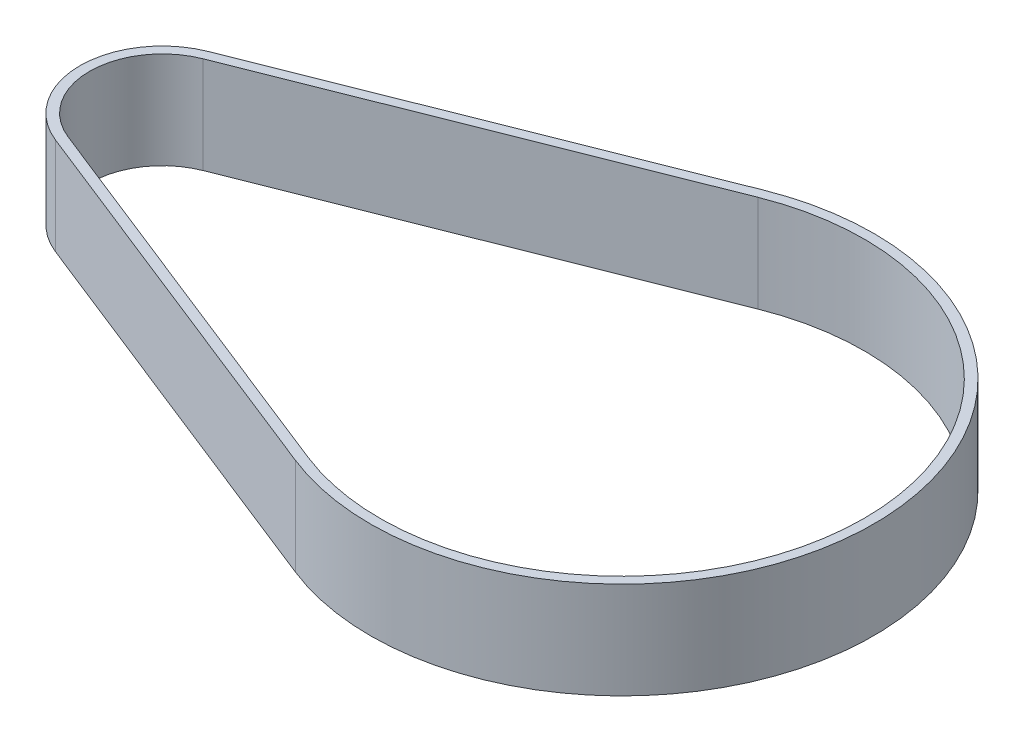
ISO-10303-21;
HEADER;
FILE_DESCRIPTION(('STEP AP214'),'2;1');
FILE_NAME('part.step','',(''),(''),'','','');
FILE_SCHEMA(('AUTOMOTIVE_DESIGN { 1 0 10303 214 1 1 1 1 }'));
ENDSEC;
DATA;
#1=APPLICATION_CONTEXT('core data for automotive mechanical design processes');
#2=APPLICATION_PROTOCOL_DEFINITION('international standard','automotive_design',2000,#1);
#3=PRODUCT_CONTEXT('',#1,'mechanical');
#4=PRODUCT('Part','Part','',(#3));
#5=PRODUCT_RELATED_PRODUCT_CATEGORY('part','',(#4));
#6=PRODUCT_DEFINITION_FORMATION('','',#4);
#7=PRODUCT_DEFINITION_CONTEXT('part definition',#1,'design');
#8=PRODUCT_DEFINITION('design','',#6,#7);
#9=PRODUCT_DEFINITION_SHAPE('','',#8);
#10=(LENGTH_UNIT() NAMED_UNIT(*) SI_UNIT(.MILLI.,.METRE.));
#11=(NAMED_UNIT(*) PLANE_ANGLE_UNIT() SI_UNIT($,.RADIAN.));
#12=(NAMED_UNIT(*) SI_UNIT($,.STERADIAN.) SOLID_ANGLE_UNIT());
#13=UNCERTAINTY_MEASURE_WITH_UNIT(LENGTH_MEASURE(1.E-05),#10,'distance_accuracy_value','');
#14=(GEOMETRIC_REPRESENTATION_CONTEXT(3) GLOBAL_UNCERTAINTY_ASSIGNED_CONTEXT((#13)) GLOBAL_UNIT_ASSIGNED_CONTEXT((#10,
#11,#12)) REPRESENTATION_CONTEXT('',''));
#15=CARTESIAN_POINT('',(0.,0.,0.));
#16=DIRECTION('',(0.,0.,1.));
#17=DIRECTION('',(1.,0.,0.));
#18=AXIS2_PLACEMENT_3D('',#15,#16,#17);
#19=CARTESIAN_POINT('',(-45.2896375275037,10.,0.));
#20=DIRECTION('',(0.,1.,0.));
#21=DIRECTION('',(0.,0.,1.));
#22=AXIS2_PLACEMENT_3D('',#19,#20,#21);
#23=PLANE('',#22);
#24=CARTESIAN_POINT('',(-45.2896375275037,10.,0.));
#25=DIRECTION('',(0.,1.,0.));
#26=DIRECTION('',(0.,0.,1.));
#27=AXIS2_PLACEMENT_3D('',#24,#25,#26);
#28=CIRCLE('',#27,8.5);
#29=CARTESIAN_POINT('',(-48.4212164748722,10.,-7.90210182776702));
#30=VERTEX_POINT('',#29);
#31=CARTESIAN_POINT('',(-48.4212164748722,10.,7.90210182776702));
#32=VERTEX_POINT('',#31);
#33=EDGE_CURVE('E134',#30,#32,#28,.T.);
#34=ORIENTED_EDGE('',*,*,#33,.T.);
#35=DIRECTION('',(0.929659038560826,0.,0.368421052631579));
#36=VECTOR('',#35,1.);
#37=CARTESIAN_POINT('',(-48.4212164748722,10.,7.90210182776702));
#38=LINE('',#37,#36);
#39=CARTESIAN_POINT('',(-7.36858489592479,10.,24.1711350025815));
#40=VERTEX_POINT('',#39);
#41=EDGE_CURVE('E137',#32,#40,#38,.T.);
#42=ORIENTED_EDGE('',*,*,#41,.T.);
#43=CARTESIAN_POINT('',(2.21036247249627,10.,0.));
#44=DIRECTION('',(0.,1.,0.));
#45=DIRECTION('',(0.,0.,1.));
#46=AXIS2_PLACEMENT_3D('',#43,#44,#45);
#47=CIRCLE('',#46,26.);
#48=CARTESIAN_POINT('',(-7.36858489592479,10.,-24.1711350025815));
#49=VERTEX_POINT('',#48);
#50=EDGE_CURVE('E140',#40,#49,#47,.T.);
#51=ORIENTED_EDGE('',*,*,#50,.T.);
#52=DIRECTION('',(-0.929659038560826,0.,0.368421052631579));
#53=VECTOR('',#52,1.);
#54=CARTESIAN_POINT('',(-48.4212164748722,10.,-7.90210182776702));
#55=LINE('',#54,#53);
#56=EDGE_CURVE('E142',#49,#30,#55,.T.);
#57=ORIENTED_EDGE('',*,*,#56,.T.);
#58=EDGE_LOOP('',(#34,#42,#51,#57));
#59=FACE_BOUND('',#58,.T.);
#60=DIRECTION('',(0.929659038560826,0.,0.368421052631579));
#61=VECTOR('',#60,1.);
#62=CARTESIAN_POINT('',(-48.0527954222406,10.,6.9724427892062));
#63=LINE('',#62,#61);
#64=CARTESIAN_POINT('',(-48.0527954222406,10.,6.9724427892062));
#65=VERTEX_POINT('',#64);
#66=CARTESIAN_POINT('',(-7.0001638432932,10.,23.2414759640206));
#67=VERTEX_POINT('',#66);
#68=EDGE_CURVE('E106',#65,#67,#63,.T.);
#69=ORIENTED_EDGE('',*,*,#68,.F.);
#70=CARTESIAN_POINT('',(-45.2896375275037,10.,0.));
#71=DIRECTION('',(0.,1.,0.));
#72=DIRECTION('',(0.,0.,1.));
#73=AXIS2_PLACEMENT_3D('',#70,#71,#72);
#74=CIRCLE('',#73,7.5);
#75=CARTESIAN_POINT('',(-48.0527954222406,10.,-6.97244278920619));
#76=VERTEX_POINT('',#75);
#77=EDGE_CURVE('E98',#76,#65,#74,.T.);
#78=ORIENTED_EDGE('',*,*,#77,.F.);
#79=DIRECTION('',(-0.929659038560826,0.,0.368421052631579));
#80=VECTOR('',#79,1.);
#81=CARTESIAN_POINT('',(-48.0527954222406,10.,-6.97244278920619));
#82=LINE('',#81,#80);
#83=CARTESIAN_POINT('',(-7.0001638432932,10.,-23.2414759640206));
#84=VERTEX_POINT('',#83);
#85=EDGE_CURVE('E120',#84,#76,#82,.T.);
#86=ORIENTED_EDGE('',*,*,#85,.F.);
#87=CARTESIAN_POINT('',(2.21036247249627,10.,0.));
#88=DIRECTION('',(0.,1.,0.));
#89=DIRECTION('',(0.,0.,1.));
#90=AXIS2_PLACEMENT_3D('',#87,#88,#89);
#91=CIRCLE('',#90,25.);
#92=EDGE_CURVE('E118',#67,#84,#91,.T.);
#93=ORIENTED_EDGE('',*,*,#92,.F.);
#94=EDGE_LOOP('',(#69,#78,#86,#93));
#95=FACE_BOUND('',#94,.T.);
#96=ADVANCED_FACE('F33',(#59,#95),#23,.T.);
#97=CARTESIAN_POINT('',(-45.2896375275037,0.,0.));
#98=DIRECTION('',(0.,1.,0.));
#99=DIRECTION('',(0.,0.,1.));
#100=AXIS2_PLACEMENT_3D('',#97,#98,#99);
#101=PLANE('',#100);
#102=CARTESIAN_POINT('',(-45.2896375275037,0.,0.));
#103=DIRECTION('',(0.,1.,0.));
#104=DIRECTION('',(0.,0.,1.));
#105=AXIS2_PLACEMENT_3D('',#102,#103,#104);
#106=CIRCLE('',#105,8.5);
#107=CARTESIAN_POINT('',(-48.4212164748722,0.,-7.90210182776702));
#108=VERTEX_POINT('',#107);
#109=CARTESIAN_POINT('',(-48.4212164748722,0.,7.90210182776702));
#110=VERTEX_POINT('',#109);
#111=EDGE_CURVE('E114',#108,#110,#106,.T.);
#112=ORIENTED_EDGE('',*,*,#111,.F.);
#113=DIRECTION('',(-0.929659038560826,0.,0.368421052631579));
#114=VECTOR('',#113,1.);
#115=CARTESIAN_POINT('',(-48.4212164748722,0.,-7.90210182776702));
#116=LINE('',#115,#114);
#117=CARTESIAN_POINT('',(-7.36858489592479,0.,-24.1711350025815));
#118=VERTEX_POINT('',#117);
#119=EDGE_CURVE('E138',#118,#108,#116,.T.);
#120=ORIENTED_EDGE('',*,*,#119,.F.);
#121=CARTESIAN_POINT('',(2.21036247249627,0.,0.));
#122=DIRECTION('',(0.,1.,0.));
#123=DIRECTION('',(0.,0.,1.));
#124=AXIS2_PLACEMENT_3D('',#121,#122,#123);
#125=CIRCLE('',#124,26.);
#126=CARTESIAN_POINT('',(-7.36858489592479,0.,24.1711350025815));
#127=VERTEX_POINT('',#126);
#128=EDGE_CURVE('E149',#127,#118,#125,.T.);
#129=ORIENTED_EDGE('',*,*,#128,.F.);
#130=DIRECTION('',(0.929659038560826,0.,0.368421052631579));
#131=VECTOR('',#130,1.);
#132=CARTESIAN_POINT('',(-48.4212164748722,0.,7.90210182776702));
#133=LINE('',#132,#131);
#134=EDGE_CURVE('E147',#110,#127,#133,.T.);
#135=ORIENTED_EDGE('',*,*,#134,.F.);
#136=EDGE_LOOP('',(#112,#120,#129,#135));
#137=FACE_BOUND('',#136,.T.);
#138=CARTESIAN_POINT('',(-45.2896375275037,0.,0.));
#139=DIRECTION('',(0.,1.,0.));
#140=DIRECTION('',(0.,0.,1.));
#141=AXIS2_PLACEMENT_3D('',#138,#139,#140);
#142=CIRCLE('',#141,7.5);
#143=CARTESIAN_POINT('',(-48.0527954222406,0.,-6.97244278920619));
#144=VERTEX_POINT('',#143);
#145=CARTESIAN_POINT('',(-48.0527954222406,0.,6.9724427892062));
#146=VERTEX_POINT('',#145);
#147=EDGE_CURVE('E56',#144,#146,#142,.T.);
#148=ORIENTED_EDGE('',*,*,#147,.T.);
#149=DIRECTION('',(0.929659038560826,0.,0.368421052631579));
#150=VECTOR('',#149,1.);
#151=CARTESIAN_POINT('',(-48.0527954222406,0.,6.9724427892062));
#152=LINE('',#151,#150);
#153=CARTESIAN_POINT('',(-7.0001638432932,0.,23.2414759640206));
#154=VERTEX_POINT('',#153);
#155=EDGE_CURVE('E113',#146,#154,#152,.T.);
#156=ORIENTED_EDGE('',*,*,#155,.T.);
#157=CARTESIAN_POINT('',(2.21036247249627,0.,0.));
#158=DIRECTION('',(0.,1.,0.));
#159=DIRECTION('',(0.,0.,1.));
#160=AXIS2_PLACEMENT_3D('',#157,#158,#159);
#161=CIRCLE('',#160,25.);
#162=CARTESIAN_POINT('',(-7.00016384329319,0.,-23.2414759640206));
#163=VERTEX_POINT('',#162);
#164=EDGE_CURVE('E126',#154,#163,#161,.T.);
#165=ORIENTED_EDGE('',*,*,#164,.T.);
#166=DIRECTION('',(-0.929659038560826,0.,0.368421052631579));
#167=VECTOR('',#166,1.);
#168=CARTESIAN_POINT('',(-48.0527954222406,0.,-6.97244278920619));
#169=LINE('',#168,#167);
#170=EDGE_CURVE('E107',#163,#144,#169,.T.);
#171=ORIENTED_EDGE('',*,*,#170,.T.);
#172=EDGE_LOOP('',(#148,#156,#165,#171));
#173=FACE_BOUND('',#172,.T.);
#174=ADVANCED_FACE('F167',(#137,#173),#101,.F.);
#175=CARTESIAN_POINT('',(-45.2896375275037,10.,0.));
#176=DIRECTION('',(0.,-1.,0.));
#177=DIRECTION('',(0.,0.,-1.));
#178=AXIS2_PLACEMENT_3D('',#175,#176,#177);
#179=CYLINDRICAL_SURFACE('',#178,8.5);
#180=ORIENTED_EDGE('',*,*,#111,.T.);
#181=DIRECTION('',(0.,-1.,0.));
#182=VECTOR('',#181,1.);
#183=CARTESIAN_POINT('',(-48.4212164748722,10.,7.90210182776702));
#184=LINE('',#183,#182);
#185=EDGE_CURVE('E11',#32,#110,#184,.T.);
#186=ORIENTED_EDGE('',*,*,#185,.F.);
#187=ORIENTED_EDGE('',*,*,#33,.F.);
#188=DIRECTION('',(0.,-1.,0.));
#189=VECTOR('',#188,1.);
#190=CARTESIAN_POINT('',(-48.4212164748722,10.,-7.90210182776702));
#191=LINE('',#190,#189);
#192=EDGE_CURVE('E144',#30,#108,#191,.T.);
#193=ORIENTED_EDGE('',*,*,#192,.T.);
#194=EDGE_LOOP('',(#180,#186,#187,#193));
#195=FACE_BOUND('',#194,.T.);
#196=ADVANCED_FACE('F35',(#195),#179,.T.);
#197=CARTESIAN_POINT('',(-48.4212164748722,10.,7.90210182776702));
#198=DIRECTION('',(0.368421052631579,0.,-0.929659038560826));
#199=DIRECTION('',(-0.929659038560826,0.,-0.368421052631579));
#200=AXIS2_PLACEMENT_3D('',#197,#198,#199);
#201=PLANE('',#200);
#202=ORIENTED_EDGE('',*,*,#134,.T.);
#203=DIRECTION('',(0.,-1.,0.));
#204=VECTOR('',#203,1.);
#205=CARTESIAN_POINT('',(-7.36858489592479,10.,24.1711350025815));
#206=LINE('',#205,#204);
#207=EDGE_CURVE('E41',#40,#127,#206,.T.);
#208=ORIENTED_EDGE('',*,*,#207,.F.);
#209=ORIENTED_EDGE('',*,*,#41,.F.);
#210=ORIENTED_EDGE('',*,*,#185,.T.);
#211=EDGE_LOOP('',(#202,#208,#209,#210));
#212=FACE_BOUND('',#211,.T.);
#213=ADVANCED_FACE('F177',(#212),#201,.F.);
#214=CARTESIAN_POINT('',(2.21036247249627,10.,0.));
#215=DIRECTION('',(0.,-1.,0.));
#216=DIRECTION('',(0.,0.,-1.));
#217=AXIS2_PLACEMENT_3D('',#214,#215,#216);
#218=CYLINDRICAL_SURFACE('',#217,26.);
#219=ORIENTED_EDGE('',*,*,#128,.T.);
#220=DIRECTION('',(0.,-1.,0.));
#221=VECTOR('',#220,1.);
#222=CARTESIAN_POINT('',(-7.36858489592479,10.,-24.1711350025815));
#223=LINE('',#222,#221);
#224=EDGE_CURVE('E154',#49,#118,#223,.T.);
#225=ORIENTED_EDGE('',*,*,#224,.F.);
#226=ORIENTED_EDGE('',*,*,#50,.F.);
#227=ORIENTED_EDGE('',*,*,#207,.T.);
#228=EDGE_LOOP('',(#219,#225,#226,#227));
#229=FACE_BOUND('',#228,.T.);
#230=ADVANCED_FACE('F161',(#229),#218,.T.);
#231=CARTESIAN_POINT('',(-48.4212164748722,10.,-7.90210182776702));
#232=DIRECTION('',(0.368421052631579,0.,0.929659038560826));
#233=DIRECTION('',(0.929659038560826,0.,-0.368421052631579));
#234=AXIS2_PLACEMENT_3D('',#231,#232,#233);
#235=PLANE('',#234);
#236=ORIENTED_EDGE('',*,*,#119,.T.);
#237=ORIENTED_EDGE('',*,*,#192,.F.);
#238=ORIENTED_EDGE('',*,*,#56,.F.);
#239=ORIENTED_EDGE('',*,*,#224,.T.);
#240=EDGE_LOOP('',(#236,#237,#238,#239));
#241=FACE_BOUND('',#240,.T.);
#242=ADVANCED_FACE('F171',(#241),#235,.F.);
#243=CARTESIAN_POINT('',(-45.2896375275037,10.,0.));
#244=DIRECTION('',(0.,-1.,0.));
#245=DIRECTION('',(0.,0.,-1.));
#246=AXIS2_PLACEMENT_3D('',#243,#244,#245);
#247=CYLINDRICAL_SURFACE('',#246,7.5);
#248=ORIENTED_EDGE('',*,*,#147,.F.);
#249=DIRECTION('',(0.,-1.,0.));
#250=VECTOR('',#249,1.);
#251=CARTESIAN_POINT('',(-48.0527954222406,10.,-6.97244278920619));
#252=LINE('',#251,#250);
#253=EDGE_CURVE('E102',#76,#144,#252,.T.);
#254=ORIENTED_EDGE('',*,*,#253,.F.);
#255=ORIENTED_EDGE('',*,*,#77,.T.);
#256=DIRECTION('',(0.,-1.,0.));
#257=VECTOR('',#256,1.);
#258=CARTESIAN_POINT('',(-48.0527954222406,10.,6.9724427892062));
#259=LINE('',#258,#257);
#260=EDGE_CURVE('E101',#65,#146,#259,.T.);
#261=ORIENTED_EDGE('',*,*,#260,.T.);
#262=EDGE_LOOP('',(#248,#254,#255,#261));
#263=FACE_BOUND('',#262,.T.);
#264=ADVANCED_FACE('F100',(#263),#247,.F.);
#265=CARTESIAN_POINT('',(-48.0527954222406,10.,6.9724427892062));
#266=DIRECTION('',(0.368421052631579,0.,-0.929659038560826));
#267=DIRECTION('',(-0.929659038560826,0.,-0.368421052631579));
#268=AXIS2_PLACEMENT_3D('',#265,#266,#267);
#269=PLANE('',#268);
#270=ORIENTED_EDGE('',*,*,#155,.F.);
#271=ORIENTED_EDGE('',*,*,#260,.F.);
#272=ORIENTED_EDGE('',*,*,#68,.T.);
#273=DIRECTION('',(0.,-1.,0.));
#274=VECTOR('',#273,1.);
#275=CARTESIAN_POINT('',(-7.0001638432932,10.,23.2414759640206));
#276=LINE('',#275,#274);
#277=EDGE_CURVE('E115',#67,#154,#276,.T.);
#278=ORIENTED_EDGE('',*,*,#277,.T.);
#279=EDGE_LOOP('',(#270,#271,#272,#278));
#280=FACE_BOUND('',#279,.T.);
#281=ADVANCED_FACE('F110',(#280),#269,.T.);
#282=CARTESIAN_POINT('',(2.21036247249627,10.,0.));
#283=DIRECTION('',(0.,-1.,0.));
#284=DIRECTION('',(0.,0.,-1.));
#285=AXIS2_PLACEMENT_3D('',#282,#283,#284);
#286=CYLINDRICAL_SURFACE('',#285,25.);
#287=ORIENTED_EDGE('',*,*,#164,.F.);
#288=ORIENTED_EDGE('',*,*,#277,.F.);
#289=ORIENTED_EDGE('',*,*,#92,.T.);
#290=DIRECTION('',(0.,-1.,0.));
#291=VECTOR('',#290,1.);
#292=CARTESIAN_POINT('',(-7.00016384329319,10.,-23.2414759640206));
#293=LINE('',#292,#291);
#294=EDGE_CURVE('E48',#84,#163,#293,.T.);
#295=ORIENTED_EDGE('',*,*,#294,.T.);
#296=EDGE_LOOP('',(#287,#288,#289,#295));
#297=FACE_BOUND('',#296,.T.);
#298=ADVANCED_FACE('F200',(#297),#286,.F.);
#299=CARTESIAN_POINT('',(-48.0527954222406,10.,-6.97244278920619));
#300=DIRECTION('',(0.368421052631579,0.,0.929659038560826));
#301=DIRECTION('',(0.929659038560826,0.,-0.368421052631579));
#302=AXIS2_PLACEMENT_3D('',#299,#300,#301);
#303=PLANE('',#302);
#304=ORIENTED_EDGE('',*,*,#170,.F.);
#305=ORIENTED_EDGE('',*,*,#294,.F.);
#306=ORIENTED_EDGE('',*,*,#85,.T.);
#307=ORIENTED_EDGE('',*,*,#253,.T.);
#308=EDGE_LOOP('',(#304,#305,#306,#307));
#309=FACE_BOUND('',#308,.T.);
#310=ADVANCED_FACE('F204',(#309),#303,.T.);
#311=CLOSED_SHELL('',(#96,#174,#196,#213,#230,#242,#264,#281,#298,#310));
#312=MANIFOLD_SOLID_BREP('B2',#311);
#313=ADVANCED_BREP_SHAPE_REPRESENTATION('',(#18,#312),#14);
#314=SHAPE_DEFINITION_REPRESENTATION(#9,#313);
ENDSEC;
END-ISO-10303-21;
